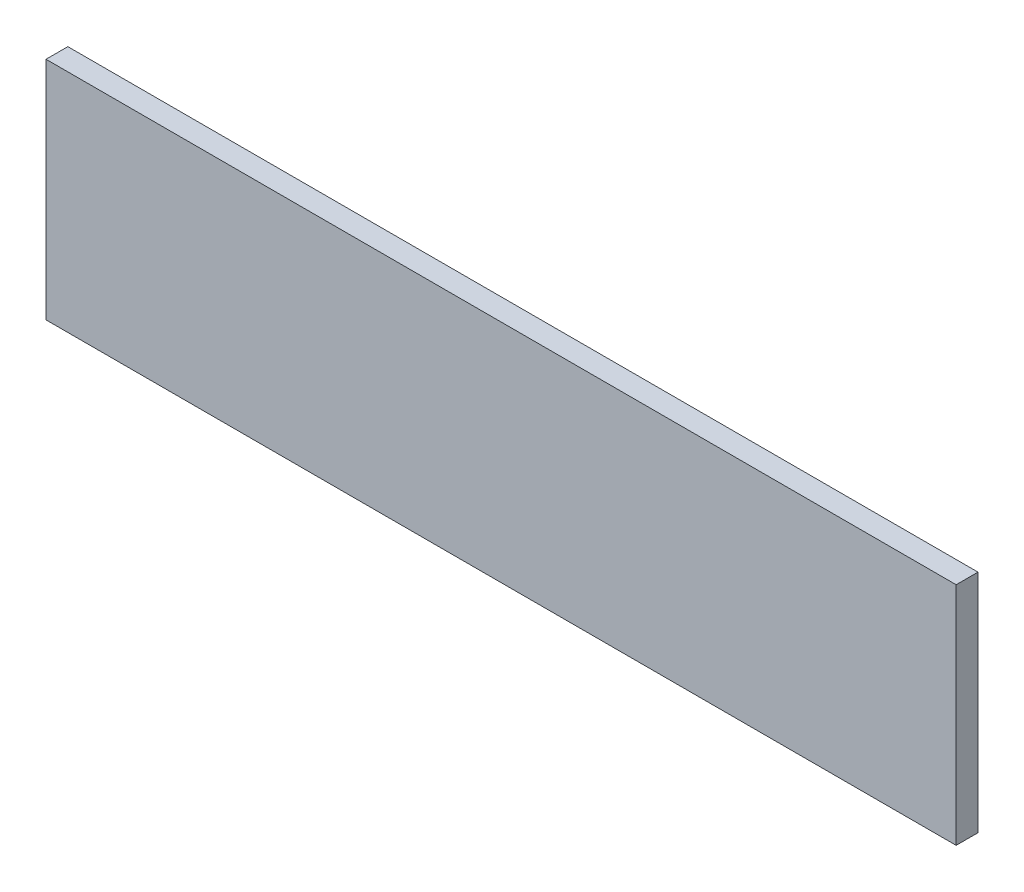
ISO-10303-21;
HEADER;
FILE_DESCRIPTION(('STEP AP214'),'2;1');
FILE_NAME('part.step','',(''),(''),'','','');
FILE_SCHEMA(('AUTOMOTIVE_DESIGN { 1 0 10303 214 1 1 1 1 }'));
ENDSEC;
DATA;
#1=APPLICATION_CONTEXT('core data for automotive mechanical design processes');
#2=APPLICATION_PROTOCOL_DEFINITION('international standard','automotive_design',2000,#1);
#3=PRODUCT_CONTEXT('',#1,'mechanical');
#4=PRODUCT('Part','Part','',(#3));
#5=PRODUCT_RELATED_PRODUCT_CATEGORY('part','',(#4));
#6=PRODUCT_DEFINITION_FORMATION('','',#4);
#7=PRODUCT_DEFINITION_CONTEXT('part definition',#1,'design');
#8=PRODUCT_DEFINITION('design','',#6,#7);
#9=PRODUCT_DEFINITION_SHAPE('','',#8);
#10=(LENGTH_UNIT() NAMED_UNIT(*) SI_UNIT(.MILLI.,.METRE.));
#11=(NAMED_UNIT(*) PLANE_ANGLE_UNIT() SI_UNIT($,.RADIAN.));
#12=(NAMED_UNIT(*) SI_UNIT($,.STERADIAN.) SOLID_ANGLE_UNIT());
#13=UNCERTAINTY_MEASURE_WITH_UNIT(LENGTH_MEASURE(1.E-05),#10,'distance_accuracy_value','');
#14=(GEOMETRIC_REPRESENTATION_CONTEXT(3) GLOBAL_UNCERTAINTY_ASSIGNED_CONTEXT((#13)) GLOBAL_UNIT_ASSIGNED_CONTEXT((#10,
#11,#12)) REPRESENTATION_CONTEXT('',''));
#15=CARTESIAN_POINT('',(0.,0.,0.));
#16=DIRECTION('',(0.,0.,1.));
#17=DIRECTION('',(1.,0.,0.));
#18=AXIS2_PLACEMENT_3D('',#15,#16,#17);
#19=CARTESIAN_POINT('',(62.5,15.5,3.));
#20=DIRECTION('',(-1.,0.,0.));
#21=DIRECTION('',(0.,0.,1.));
#22=AXIS2_PLACEMENT_3D('',#19,#20,#21);
#23=PLANE('',#22);
#24=DIRECTION('',(0.,1.,0.));
#25=VECTOR('',#24,1.);
#26=CARTESIAN_POINT('',(62.5,15.5,0.));
#27=LINE('',#26,#25);
#28=CARTESIAN_POINT('',(62.5,-15.5,0.));
#29=VERTEX_POINT('',#28);
#30=CARTESIAN_POINT('',(62.5,15.5,0.));
#31=VERTEX_POINT('',#30);
#32=EDGE_CURVE('E96',#29,#31,#27,.T.);
#33=ORIENTED_EDGE('',*,*,#32,.T.);
#34=DIRECTION('',(0.,0.,-1.));
#35=VECTOR('',#34,1.);
#36=CARTESIAN_POINT('',(62.5,15.5,3.));
#37=LINE('',#36,#35);
#38=CARTESIAN_POINT('',(62.5,15.5,3.));
#39=VERTEX_POINT('',#38);
#40=EDGE_CURVE('E11',#39,#31,#37,.T.);
#41=ORIENTED_EDGE('',*,*,#40,.F.);
#42=DIRECTION('',(0.,1.,0.));
#43=VECTOR('',#42,1.);
#44=CARTESIAN_POINT('',(62.5,15.5,3.));
#45=LINE('',#44,#43);
#46=CARTESIAN_POINT('',(62.5,-15.5,3.));
#47=VERTEX_POINT('',#46);
#48=EDGE_CURVE('E84',#47,#39,#45,.T.);
#49=ORIENTED_EDGE('',*,*,#48,.F.);
#50=DIRECTION('',(0.,0.,-1.));
#51=VECTOR('',#50,1.);
#52=CARTESIAN_POINT('',(62.5,-15.5,3.));
#53=LINE('',#52,#51);
#54=EDGE_CURVE('E92',#47,#29,#53,.T.);
#55=ORIENTED_EDGE('',*,*,#54,.T.);
#56=EDGE_LOOP('',(#33,#41,#49,#55));
#57=FACE_BOUND('',#56,.T.);
#58=ADVANCED_FACE('F33',(#57),#23,.F.);
#59=CARTESIAN_POINT('',(-62.5,15.5,3.));
#60=DIRECTION('',(0.,-1.,0.));
#61=DIRECTION('',(0.,0.,-1.));
#62=AXIS2_PLACEMENT_3D('',#59,#60,#61);
#63=PLANE('',#62);
#64=DIRECTION('',(-1.,0.,0.));
#65=VECTOR('',#64,1.);
#66=CARTESIAN_POINT('',(-62.5,15.5,0.));
#67=LINE('',#66,#65);
#68=CARTESIAN_POINT('',(-62.5,15.5,0.));
#69=VERTEX_POINT('',#68);
#70=EDGE_CURVE('E88',#31,#69,#67,.T.);
#71=ORIENTED_EDGE('',*,*,#70,.T.);
#72=DIRECTION('',(0.,0.,-1.));
#73=VECTOR('',#72,1.);
#74=CARTESIAN_POINT('',(-62.5,15.5,3.));
#75=LINE('',#74,#73);
#76=CARTESIAN_POINT('',(-62.5,15.5,3.));
#77=VERTEX_POINT('',#76);
#78=EDGE_CURVE('E41',#77,#69,#75,.T.);
#79=ORIENTED_EDGE('',*,*,#78,.F.);
#80=DIRECTION('',(-1.,0.,0.));
#81=VECTOR('',#80,1.);
#82=CARTESIAN_POINT('',(-62.5,15.5,3.));
#83=LINE('',#82,#81);
#84=EDGE_CURVE('E79',#39,#77,#83,.T.);
#85=ORIENTED_EDGE('',*,*,#84,.F.);
#86=ORIENTED_EDGE('',*,*,#40,.T.);
#87=EDGE_LOOP('',(#71,#79,#85,#86));
#88=FACE_BOUND('',#87,.T.);
#89=ADVANCED_FACE('F87',(#88),#63,.F.);
#90=CARTESIAN_POINT('',(-62.5,15.5,3.));
#91=DIRECTION('',(1.,0.,0.));
#92=DIRECTION('',(0.,1.,0.));
#93=AXIS2_PLACEMENT_3D('',#90,#91,#92);
#94=PLANE('',#93);
#95=DIRECTION('',(0.,-1.,0.));
#96=VECTOR('',#95,1.);
#97=CARTESIAN_POINT('',(-62.5,15.5,0.));
#98=LINE('',#97,#96);
#99=CARTESIAN_POINT('',(-62.5,-15.5,0.));
#100=VERTEX_POINT('',#99);
#101=EDGE_CURVE('E66',#69,#100,#98,.T.);
#102=ORIENTED_EDGE('',*,*,#101,.T.);
#103=DIRECTION('',(0.,0.,-1.));
#104=VECTOR('',#103,1.);
#105=CARTESIAN_POINT('',(-62.5,-15.5,3.));
#106=LINE('',#105,#104);
#107=CARTESIAN_POINT('',(-62.5,-15.5,3.));
#108=VERTEX_POINT('',#107);
#109=EDGE_CURVE('E89',#108,#100,#106,.T.);
#110=ORIENTED_EDGE('',*,*,#109,.F.);
#111=DIRECTION('',(0.,-1.,0.));
#112=VECTOR('',#111,1.);
#113=CARTESIAN_POINT('',(-62.5,15.5,3.));
#114=LINE('',#113,#112);
#115=EDGE_CURVE('E82',#77,#108,#114,.T.);
#116=ORIENTED_EDGE('',*,*,#115,.F.);
#117=ORIENTED_EDGE('',*,*,#78,.T.);
#118=EDGE_LOOP('',(#102,#110,#116,#117));
#119=FACE_BOUND('',#118,.T.);
#120=ADVANCED_FACE('F90',(#119),#94,.F.);
#121=CARTESIAN_POINT('',(-62.5,-15.5,3.));
#122=DIRECTION('',(0.,1.,0.));
#123=DIRECTION('',(0.,0.,1.));
#124=AXIS2_PLACEMENT_3D('',#121,#122,#123);
#125=PLANE('',#124);
#126=DIRECTION('',(1.,0.,0.));
#127=VECTOR('',#126,1.);
#128=CARTESIAN_POINT('',(-62.5,-15.5,0.));
#129=LINE('',#128,#127);
#130=EDGE_CURVE('E72',#100,#29,#129,.T.);
#131=ORIENTED_EDGE('',*,*,#130,.T.);
#132=ORIENTED_EDGE('',*,*,#54,.F.);
#133=DIRECTION('',(1.,0.,0.));
#134=VECTOR('',#133,1.);
#135=CARTESIAN_POINT('',(-62.5,-15.5,3.));
#136=LINE('',#135,#134);
#137=EDGE_CURVE('E49',#108,#47,#136,.T.);
#138=ORIENTED_EDGE('',*,*,#137,.F.);
#139=ORIENTED_EDGE('',*,*,#109,.T.);
#140=EDGE_LOOP('',(#131,#132,#138,#139));
#141=FACE_BOUND('',#140,.T.);
#142=ADVANCED_FACE('F103',(#141),#125,.F.);
#143=CARTESIAN_POINT('',(0.,0.,3.));
#144=DIRECTION('',(0.,0.,1.));
#145=DIRECTION('',(1.,0.,0.));
#146=AXIS2_PLACEMENT_3D('',#143,#144,#145);
#147=PLANE('',#146);
#148=ORIENTED_EDGE('',*,*,#48,.T.);
#149=ORIENTED_EDGE('',*,*,#84,.T.);
#150=ORIENTED_EDGE('',*,*,#115,.T.);
#151=ORIENTED_EDGE('',*,*,#137,.T.);
#152=EDGE_LOOP('',(#148,#149,#150,#151));
#153=FACE_BOUND('',#152,.T.);
#154=ADVANCED_FACE('F80',(#153),#147,.T.);
#155=CARTESIAN_POINT('',(0.,0.,0.));
#156=DIRECTION('',(0.,0.,1.));
#157=DIRECTION('',(1.,0.,0.));
#158=AXIS2_PLACEMENT_3D('',#155,#156,#157);
#159=PLANE('',#158);
#160=ORIENTED_EDGE('',*,*,#32,.F.);
#161=ORIENTED_EDGE('',*,*,#130,.F.);
#162=ORIENTED_EDGE('',*,*,#101,.F.);
#163=ORIENTED_EDGE('',*,*,#70,.F.);
#164=EDGE_LOOP('',(#160,#161,#162,#163));
#165=FACE_BOUND('',#164,.T.);
#166=ADVANCED_FACE('F106',(#165),#159,.F.);
#167=CLOSED_SHELL('',(#58,#89,#120,#142,#154,#166));
#168=MANIFOLD_SOLID_BREP('B2',#167);
#169=ADVANCED_BREP_SHAPE_REPRESENTATION('',(#18,#168),#14);
#170=SHAPE_DEFINITION_REPRESENTATION(#9,#169);
ENDSEC;
END-ISO-10303-21;
